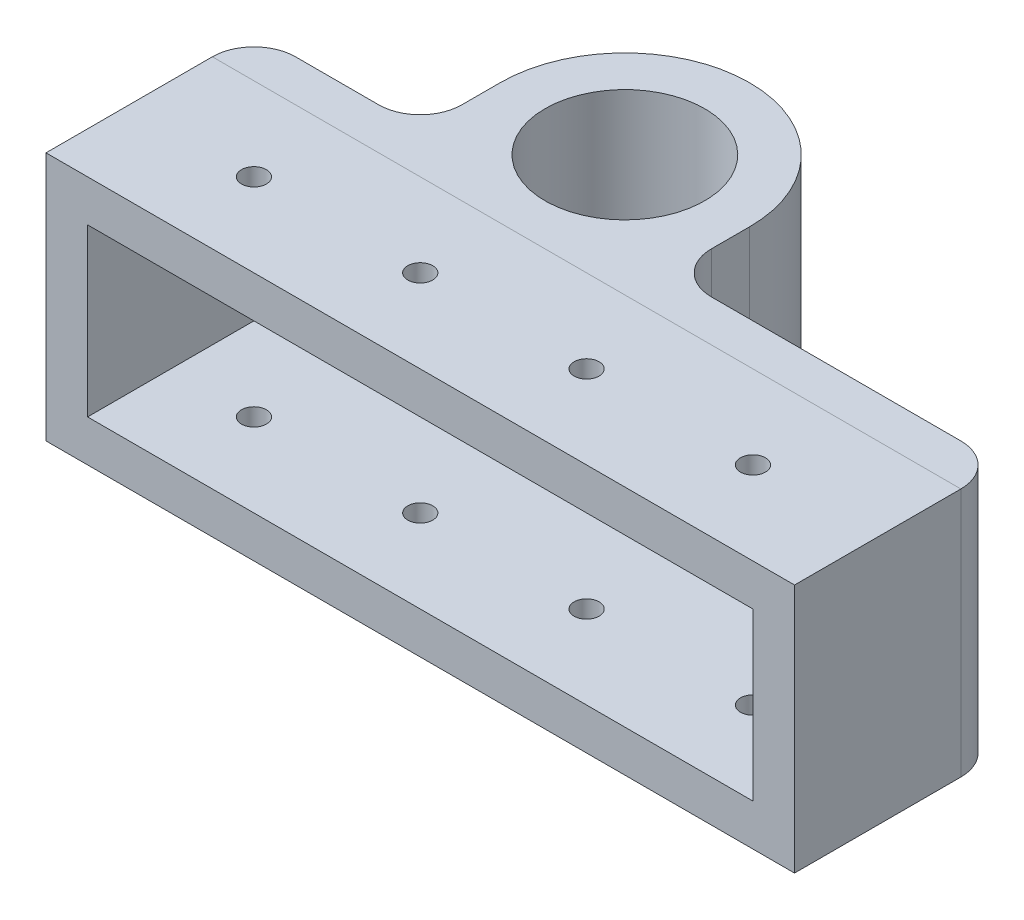
ISO-10303-21;
HEADER;
FILE_DESCRIPTION(('STEP AP214'),'2;1');
FILE_NAME('part.step','',(''),(''),'','','');
FILE_SCHEMA(('AUTOMOTIVE_DESIGN { 1 0 10303 214 1 1 1 1 }'));
ENDSEC;
DATA;
#1=APPLICATION_CONTEXT('core data for automotive mechanical design processes');
#2=APPLICATION_PROTOCOL_DEFINITION('international standard','automotive_design',2000,#1);
#3=PRODUCT_CONTEXT('',#1,'mechanical');
#4=PRODUCT('Part','Part','',(#3));
#5=PRODUCT_RELATED_PRODUCT_CATEGORY('part','',(#4));
#6=PRODUCT_DEFINITION_FORMATION('','',#4);
#7=PRODUCT_DEFINITION_CONTEXT('part definition',#1,'design');
#8=PRODUCT_DEFINITION('design','',#6,#7);
#9=PRODUCT_DEFINITION_SHAPE('','',#8);
#10=(LENGTH_UNIT() NAMED_UNIT(*) SI_UNIT(.MILLI.,.METRE.));
#11=(NAMED_UNIT(*) PLANE_ANGLE_UNIT() SI_UNIT($,.RADIAN.));
#12=(NAMED_UNIT(*) SI_UNIT($,.STERADIAN.) SOLID_ANGLE_UNIT());
#13=UNCERTAINTY_MEASURE_WITH_UNIT(LENGTH_MEASURE(1.E-05),#10,'distance_accuracy_value','');
#14=(GEOMETRIC_REPRESENTATION_CONTEXT(3) GLOBAL_UNCERTAINTY_ASSIGNED_CONTEXT((#13)) GLOBAL_UNIT_ASSIGNED_CONTEXT((#10,
#11,#12)) REPRESENTATION_CONTEXT('',''));
#15=CARTESIAN_POINT('',(0.,0.,0.));
#16=DIRECTION('',(0.,0.,1.));
#17=DIRECTION('',(1.,0.,0.));
#18=AXIS2_PLACEMENT_3D('',#15,#16,#17);
#19=CARTESIAN_POINT('',(0.,-15.,0.));
#20=DIRECTION('',(0.,0.,-1.));
#21=DIRECTION('',(-1.,0.,0.));
#22=AXIS2_PLACEMENT_3D('',#19,#20,#21);
#23=PLANE('',#22);
#24=DIRECTION('',(-1.,0.,0.));
#25=VECTOR('',#24,1.);
#26=CARTESIAN_POINT('',(0.,15.,0.));
#27=LINE('',#26,#25);
#28=CARTESIAN_POINT('',(45.,15.,0.));
#29=VERTEX_POINT('',#28);
#30=CARTESIAN_POINT('',(-45.,15.,0.));
#31=VERTEX_POINT('',#30);
#32=EDGE_CURVE('E194',#29,#31,#27,.T.);
#33=ORIENTED_EDGE('',*,*,#32,.T.);
#34=DIRECTION('',(0.,1.,0.));
#35=VECTOR('',#34,1.);
#36=CARTESIAN_POINT('',(-45.,-15.,0.));
#37=LINE('',#36,#35);
#38=CARTESIAN_POINT('',(-45.,-15.,0.));
#39=VERTEX_POINT('',#38);
#40=EDGE_CURVE('E143',#39,#31,#37,.T.);
#41=ORIENTED_EDGE('',*,*,#40,.F.);
#42=DIRECTION('',(-1.,0.,0.));
#43=VECTOR('',#42,1.);
#44=CARTESIAN_POINT('',(0.,-15.,0.));
#45=LINE('',#44,#43);
#46=CARTESIAN_POINT('',(45.,-15.,0.));
#47=VERTEX_POINT('',#46);
#48=EDGE_CURVE('E131',#47,#39,#45,.T.);
#49=ORIENTED_EDGE('',*,*,#48,.F.);
#50=DIRECTION('',(0.,1.,0.));
#51=VECTOR('',#50,1.);
#52=CARTESIAN_POINT('',(45.,-15.,0.));
#53=LINE('',#52,#51);
#54=EDGE_CURVE('E141',#47,#29,#53,.T.);
#55=ORIENTED_EDGE('',*,*,#54,.T.);
#56=EDGE_LOOP('',(#33,#41,#49,#55));
#57=FACE_BOUND('',#56,.T.);
#58=ADVANCED_FACE('F51',(#57),#23,.F.);
#59=CARTESIAN_POINT('',(0.,-15.,-5.));
#60=DIRECTION('',(0.,0.,1.));
#61=DIRECTION('',(1.,0.,0.));
#62=AXIS2_PLACEMENT_3D('',#59,#60,#61);
#63=PLANE('',#62);
#64=DIRECTION('',(1.,0.,0.));
#65=VECTOR('',#64,1.);
#66=CARTESIAN_POINT('',(0.,-15.,-5.));
#67=LINE('',#66,#65);
#68=CARTESIAN_POINT('',(-40.,-15.,-5.));
#69=VERTEX_POINT('',#68);
#70=CARTESIAN_POINT('',(-30.,-15.,-5.));
#71=VERTEX_POINT('',#70);
#72=EDGE_CURVE('E153',#69,#71,#67,.T.);
#73=ORIENTED_EDGE('',*,*,#72,.F.);
#74=DIRECTION('',(0.,1.,0.));
#75=VECTOR('',#74,1.);
#76=CARTESIAN_POINT('',(-40.,-15.,-5.));
#77=LINE('',#76,#75);
#78=CARTESIAN_POINT('',(-40.,15.,-5.));
#79=VERTEX_POINT('',#78);
#80=EDGE_CURVE('E177',#69,#79,#77,.T.);
#81=ORIENTED_EDGE('',*,*,#80,.T.);
#82=DIRECTION('',(1.,0.,0.));
#83=VECTOR('',#82,1.);
#84=CARTESIAN_POINT('',(0.,15.,-5.));
#85=LINE('',#84,#83);
#86=CARTESIAN_POINT('',(-30.,15.,-5.));
#87=VERTEX_POINT('',#86);
#88=EDGE_CURVE('E195',#79,#87,#85,.T.);
#89=ORIENTED_EDGE('',*,*,#88,.T.);
#90=DIRECTION('',(0.,1.,0.));
#91=VECTOR('',#90,1.);
#92=CARTESIAN_POINT('',(-30.,-15.,-5.));
#93=LINE('',#92,#91);
#94=EDGE_CURVE('E160',#87,#71,#93,.F.);
#95=ORIENTED_EDGE('',*,*,#94,.T.);
#96=EDGE_LOOP('',(#73,#81,#89,#95));
#97=FACE_BOUND('',#96,.T.);
#98=ADVANCED_FACE('F185',(#97),#63,.F.);
#99=CARTESIAN_POINT('',(-25.,-15.,0.));
#100=DIRECTION('',(-1.,0.,0.));
#101=DIRECTION('',(0.,-1.,0.));
#102=AXIS2_PLACEMENT_3D('',#99,#100,#101);
#103=PLANE('',#102);
#104=DIRECTION('',(0.,0.,1.));
#105=VECTOR('',#104,1.);
#106=CARTESIAN_POINT('',(-25.,-15.,0.));
#107=LINE('',#106,#105);
#108=CARTESIAN_POINT('',(-25.,-15.,-14.6));
#109=VERTEX_POINT('',#108);
#110=CARTESIAN_POINT('',(-25.,-15.,-10.));
#111=VERTEX_POINT('',#110);
#112=EDGE_CURVE('E189',#109,#111,#107,.T.);
#113=ORIENTED_EDGE('',*,*,#112,.T.);
#114=DIRECTION('',(0.,1.,0.));
#115=VECTOR('',#114,1.);
#116=CARTESIAN_POINT('',(-25.,-15.,-10.));
#117=LINE('',#116,#115);
#118=CARTESIAN_POINT('',(-25.,15.,-10.));
#119=VERTEX_POINT('',#118);
#120=EDGE_CURVE('E157',#111,#119,#117,.T.);
#121=ORIENTED_EDGE('',*,*,#120,.T.);
#122=DIRECTION('',(0.,0.,1.));
#123=VECTOR('',#122,1.);
#124=CARTESIAN_POINT('',(-25.,15.,0.));
#125=LINE('',#124,#123);
#126=CARTESIAN_POINT('',(-25.,15.,-14.6));
#127=VERTEX_POINT('',#126);
#128=EDGE_CURVE('E206',#127,#119,#125,.T.);
#129=ORIENTED_EDGE('',*,*,#128,.F.);
#130=DIRECTION('',(0.,1.,0.));
#131=VECTOR('',#130,1.);
#132=CARTESIAN_POINT('',(-25.,-15.,-14.6));
#133=LINE('',#132,#131);
#134=EDGE_CURVE('E150',#109,#127,#133,.T.);
#135=ORIENTED_EDGE('',*,*,#134,.F.);
#136=EDGE_LOOP('',(#113,#121,#129,#135));
#137=FACE_BOUND('',#136,.T.);
#138=ADVANCED_FACE('F222',(#137),#103,.T.);
#139=CARTESIAN_POINT('',(-10.,-15.,-14.6));
#140=DIRECTION('',(0.,1.,0.));
#141=DIRECTION('',(-1.,0.,0.));
#142=AXIS2_PLACEMENT_3D('',#139,#140,#141);
#143=CYLINDRICAL_SURFACE('',#142,15.);
#144=CARTESIAN_POINT('',(-10.,15.,-14.6));
#145=DIRECTION('',(0.,1.,0.));
#146=DIRECTION('',(-1.,0.,0.));
#147=AXIS2_PLACEMENT_3D('',#144,#145,#146);
#148=CIRCLE('',#147,15.);
#149=CARTESIAN_POINT('',(4.99999999999999,15.,-14.6));
#150=VERTEX_POINT('',#149);
#151=EDGE_CURVE('E203',#150,#127,#148,.T.);
#152=ORIENTED_EDGE('',*,*,#151,.F.);
#153=DIRECTION('',(0.,1.,0.));
#154=VECTOR('',#153,1.);
#155=CARTESIAN_POINT('',(4.99999999999999,-15.,-14.6));
#156=LINE('',#155,#154);
#157=CARTESIAN_POINT('',(4.99999999999999,-15.,-14.6));
#158=VERTEX_POINT('',#157);
#159=EDGE_CURVE('E147',#158,#150,#156,.T.);
#160=ORIENTED_EDGE('',*,*,#159,.F.);
#161=CARTESIAN_POINT('',(-10.,-15.,-14.6));
#162=DIRECTION('',(0.,1.,0.));
#163=DIRECTION('',(-1.,0.,0.));
#164=AXIS2_PLACEMENT_3D('',#161,#162,#163);
#165=CIRCLE('',#164,15.);
#166=EDGE_CURVE('E218',#158,#109,#165,.T.);
#167=ORIENTED_EDGE('',*,*,#166,.T.);
#168=ORIENTED_EDGE('',*,*,#134,.T.);
#169=EDGE_LOOP('',(#152,#160,#167,#168));
#170=FACE_BOUND('',#169,.T.);
#171=ADVANCED_FACE('F216',(#170),#143,.T.);
#172=CARTESIAN_POINT('',(4.99999999999999,-15.,0.));
#173=DIRECTION('',(-1.,0.,0.));
#174=DIRECTION('',(0.,0.,1.));
#175=AXIS2_PLACEMENT_3D('',#172,#173,#174);
#176=PLANE('',#175);
#177=DIRECTION('',(0.,0.,1.));
#178=VECTOR('',#177,1.);
#179=CARTESIAN_POINT('',(4.99999999999999,15.,0.));
#180=LINE('',#179,#178);
#181=CARTESIAN_POINT('',(4.99999999999999,15.,-10.));
#182=VERTEX_POINT('',#181);
#183=EDGE_CURVE('E198',#150,#182,#180,.T.);
#184=ORIENTED_EDGE('',*,*,#183,.T.);
#185=DIRECTION('',(0.,1.,0.));
#186=VECTOR('',#185,1.);
#187=CARTESIAN_POINT('',(4.99999999999999,-15.,-10.));
#188=LINE('',#187,#186);
#189=CARTESIAN_POINT('',(4.99999999999999,-15.,-10.));
#190=VERTEX_POINT('',#189);
#191=EDGE_CURVE('E166',#182,#190,#188,.F.);
#192=ORIENTED_EDGE('',*,*,#191,.T.);
#193=DIRECTION('',(0.,0.,1.));
#194=VECTOR('',#193,1.);
#195=CARTESIAN_POINT('',(4.99999999999999,-15.,0.));
#196=LINE('',#195,#194);
#197=EDGE_CURVE('E234',#158,#190,#196,.T.);
#198=ORIENTED_EDGE('',*,*,#197,.F.);
#199=ORIENTED_EDGE('',*,*,#159,.T.);
#200=EDGE_LOOP('',(#184,#192,#198,#199));
#201=FACE_BOUND('',#200,.T.);
#202=ADVANCED_FACE('F227',(#201),#176,.F.);
#203=CARTESIAN_POINT('',(0.,-15.,-5.));
#204=DIRECTION('',(0.,0.,1.));
#205=DIRECTION('',(1.,0.,0.));
#206=AXIS2_PLACEMENT_3D('',#203,#204,#205);
#207=PLANE('',#206);
#208=DIRECTION('',(1.,0.,0.));
#209=VECTOR('',#208,1.);
#210=CARTESIAN_POINT('',(0.,15.,-5.));
#211=LINE('',#210,#209);
#212=CARTESIAN_POINT('',(9.99999999999999,15.,-5.));
#213=VERTEX_POINT('',#212);
#214=CARTESIAN_POINT('',(40.,15.,-5.));
#215=VERTEX_POINT('',#214);
#216=EDGE_CURVE('E196',#213,#215,#211,.T.);
#217=ORIENTED_EDGE('',*,*,#216,.T.);
#218=DIRECTION('',(0.,1.,0.));
#219=VECTOR('',#218,1.);
#220=CARTESIAN_POINT('',(40.,-15.,-5.));
#221=LINE('',#220,#219);
#222=CARTESIAN_POINT('',(40.,-15.,-5.));
#223=VERTEX_POINT('',#222);
#224=EDGE_CURVE('E12',#215,#223,#221,.F.);
#225=ORIENTED_EDGE('',*,*,#224,.T.);
#226=DIRECTION('',(1.,0.,0.));
#227=VECTOR('',#226,1.);
#228=CARTESIAN_POINT('',(0.,-15.,-5.));
#229=LINE('',#228,#227);
#230=CARTESIAN_POINT('',(9.99999999999999,-15.,-5.));
#231=VERTEX_POINT('',#230);
#232=EDGE_CURVE('E133',#231,#223,#229,.T.);
#233=ORIENTED_EDGE('',*,*,#232,.F.);
#234=DIRECTION('',(0.,1.,0.));
#235=VECTOR('',#234,1.);
#236=CARTESIAN_POINT('',(9.99999999999999,15.,-5.));
#237=LINE('',#236,#235);
#238=EDGE_CURVE('E163',#231,#213,#237,.T.);
#239=ORIENTED_EDGE('',*,*,#238,.T.);
#240=EDGE_LOOP('',(#217,#225,#233,#239));
#241=FACE_BOUND('',#240,.T.);
#242=ADVANCED_FACE('F235',(#241),#207,.F.);
#243=CARTESIAN_POINT('',(-10.,-15.,-14.6));
#244=DIRECTION('',(0.,1.,0.));
#245=DIRECTION('',(-1.,0.,0.));
#246=AXIS2_PLACEMENT_3D('',#243,#244,#245);
#247=CYLINDRICAL_SURFACE('',#246,9.6);
#248=CARTESIAN_POINT('',(-10.,-15.,-14.6));
#249=DIRECTION('',(0.,1.,0.));
#250=DIRECTION('',(-1.,0.,0.));
#251=AXIS2_PLACEMENT_3D('',#248,#249,#250);
#252=CIRCLE('',#251,9.6);
#253=CARTESIAN_POINT('',(-19.6,-15.,-14.6));
#254=VERTEX_POINT('',#253);
#255=EDGE_CURVE('E148',#254,#254,#252,.T.);
#256=ORIENTED_EDGE('',*,*,#255,.F.);
#257=EDGE_LOOP('',(#256));
#258=FACE_BOUND('',#257,.T.);
#259=CARTESIAN_POINT('',(-10.,15.,-14.6));
#260=DIRECTION('',(0.,1.,0.));
#261=DIRECTION('',(-1.,0.,0.));
#262=AXIS2_PLACEMENT_3D('',#259,#260,#261);
#263=CIRCLE('',#262,9.6);
#264=CARTESIAN_POINT('',(-19.6,15.,-14.6));
#265=VERTEX_POINT('',#264);
#266=EDGE_CURVE('E145',#265,#265,#263,.T.);
#267=ORIENTED_EDGE('',*,*,#266,.T.);
#268=EDGE_LOOP('',(#267));
#269=FACE_BOUND('',#268,.T.);
#270=ADVANCED_FACE('F260',(#258,#269),#247,.F.);
#271=CARTESIAN_POINT('',(0.,-15.,0.));
#272=DIRECTION('',(0.,1.,0.));
#273=DIRECTION('',(-1.,0.,0.));
#274=AXIS2_PLACEMENT_3D('',#271,#272,#273);
#275=PLANE('',#274);
#276=ORIENTED_EDGE('',*,*,#48,.T.);
#277=CARTESIAN_POINT('',(-40.,-15.,0.));
#278=DIRECTION('',(0.,1.,0.));
#279=DIRECTION('',(-1.,0.,0.));
#280=AXIS2_PLACEMENT_3D('',#277,#278,#279);
#281=CIRCLE('',#280,5.);
#282=EDGE_CURVE('E59',#39,#69,#281,.F.);
#283=ORIENTED_EDGE('',*,*,#282,.T.);
#284=ORIENTED_EDGE('',*,*,#72,.T.);
#285=CARTESIAN_POINT('',(-30.,-15.,-10.));
#286=DIRECTION('',(0.,1.,0.));
#287=DIRECTION('',(-1.,0.,0.));
#288=AXIS2_PLACEMENT_3D('',#285,#286,#287);
#289=CIRCLE('',#288,5.);
#290=EDGE_CURVE('E171',#71,#111,#289,.T.);
#291=ORIENTED_EDGE('',*,*,#290,.T.);
#292=ORIENTED_EDGE('',*,*,#112,.F.);
#293=ORIENTED_EDGE('',*,*,#166,.F.);
#294=ORIENTED_EDGE('',*,*,#197,.T.);
#295=CARTESIAN_POINT('',(9.99999999999999,-15.,-10.));
#296=DIRECTION('',(0.,1.,0.));
#297=DIRECTION('',(-1.,0.,0.));
#298=AXIS2_PLACEMENT_3D('',#295,#296,#297);
#299=CIRCLE('',#298,5.);
#300=EDGE_CURVE('E175',#190,#231,#299,.T.);
#301=ORIENTED_EDGE('',*,*,#300,.T.);
#302=ORIENTED_EDGE('',*,*,#232,.T.);
#303=CARTESIAN_POINT('',(40.,-15.,0.));
#304=DIRECTION('',(0.,1.,0.));
#305=DIRECTION('',(-1.,0.,0.));
#306=AXIS2_PLACEMENT_3D('',#303,#304,#305);
#307=CIRCLE('',#306,5.);
#308=EDGE_CURVE('E127',#223,#47,#307,.F.);
#309=ORIENTED_EDGE('',*,*,#308,.T.);
#310=EDGE_LOOP('',(#276,#283,#284,#291,#292,#293,#294,#301,#302,#309));
#311=FACE_BOUND('',#310,.T.);
#312=ORIENTED_EDGE('',*,*,#255,.T.);
#313=EDGE_LOOP('',(#312));
#314=FACE_BOUND('',#313,.T.);
#315=ADVANCED_FACE('F129',(#311,#314),#275,.F.);
#316=CARTESIAN_POINT('',(0.,15.,0.));
#317=DIRECTION('',(0.,1.,0.));
#318=DIRECTION('',(-1.,0.,0.));
#319=AXIS2_PLACEMENT_3D('',#316,#317,#318);
#320=PLANE('',#319);
#321=ORIENTED_EDGE('',*,*,#88,.F.);
#322=CARTESIAN_POINT('',(-40.,15.,0.));
#323=DIRECTION('',(0.,1.,0.));
#324=DIRECTION('',(-1.,0.,0.));
#325=AXIS2_PLACEMENT_3D('',#322,#323,#324);
#326=CIRCLE('',#325,5.);
#327=EDGE_CURVE('E136',#79,#31,#326,.T.);
#328=ORIENTED_EDGE('',*,*,#327,.T.);
#329=ORIENTED_EDGE('',*,*,#32,.F.);
#330=CARTESIAN_POINT('',(40.,15.,0.));
#331=DIRECTION('',(0.,1.,0.));
#332=DIRECTION('',(-1.,0.,0.));
#333=AXIS2_PLACEMENT_3D('',#330,#331,#332);
#334=CIRCLE('',#333,5.);
#335=EDGE_CURVE('E72',#29,#215,#334,.T.);
#336=ORIENTED_EDGE('',*,*,#335,.T.);
#337=ORIENTED_EDGE('',*,*,#216,.F.);
#338=CARTESIAN_POINT('',(9.99999999999999,15.,-10.));
#339=DIRECTION('',(0.,1.,0.));
#340=DIRECTION('',(-1.,0.,0.));
#341=AXIS2_PLACEMENT_3D('',#338,#339,#340);
#342=CIRCLE('',#341,5.);
#343=EDGE_CURVE('E173',#213,#182,#342,.F.);
#344=ORIENTED_EDGE('',*,*,#343,.T.);
#345=ORIENTED_EDGE('',*,*,#183,.F.);
#346=ORIENTED_EDGE('',*,*,#151,.T.);
#347=ORIENTED_EDGE('',*,*,#128,.T.);
#348=CARTESIAN_POINT('',(-30.,15.,-10.));
#349=DIRECTION('',(0.,1.,0.));
#350=DIRECTION('',(-1.,0.,0.));
#351=AXIS2_PLACEMENT_3D('',#348,#349,#350);
#352=CIRCLE('',#351,5.);
#353=EDGE_CURVE('E168',#119,#87,#352,.F.);
#354=ORIENTED_EDGE('',*,*,#353,.T.);
#355=EDGE_LOOP('',(#321,#328,#329,#336,#337,#344,#345,#346,#347,#354));
#356=FACE_BOUND('',#355,.T.);
#357=ORIENTED_EDGE('',*,*,#266,.F.);
#358=EDGE_LOOP('',(#357));
#359=FACE_BOUND('',#358,.T.);
#360=ADVANCED_FACE('F192',(#356,#359),#320,.T.);
#361=CARTESIAN_POINT('',(-30.,-15.,-10.));
#362=DIRECTION('',(0.,1.,0.));
#363=DIRECTION('',(-1.,0.,0.));
#364=AXIS2_PLACEMENT_3D('',#361,#362,#363);
#365=CYLINDRICAL_SURFACE('',#364,5.);
#366=ORIENTED_EDGE('',*,*,#290,.F.);
#367=ORIENTED_EDGE('',*,*,#94,.F.);
#368=ORIENTED_EDGE('',*,*,#353,.F.);
#369=ORIENTED_EDGE('',*,*,#120,.F.);
#370=EDGE_LOOP('',(#366,#367,#368,#369));
#371=FACE_BOUND('',#370,.T.);
#372=ADVANCED_FACE('F241',(#371),#365,.F.);
#373=CARTESIAN_POINT('',(9.99999999999999,-15.,-10.));
#374=DIRECTION('',(0.,-1.,0.));
#375=DIRECTION('',(1.,0.,0.));
#376=AXIS2_PLACEMENT_3D('',#373,#374,#375);
#377=CYLINDRICAL_SURFACE('',#376,5.);
#378=ORIENTED_EDGE('',*,*,#300,.F.);
#379=ORIENTED_EDGE('',*,*,#191,.F.);
#380=ORIENTED_EDGE('',*,*,#343,.F.);
#381=ORIENTED_EDGE('',*,*,#238,.F.);
#382=EDGE_LOOP('',(#378,#379,#380,#381));
#383=FACE_BOUND('',#382,.T.);
#384=ADVANCED_FACE('F232',(#383),#377,.F.);
#385=CARTESIAN_POINT('',(-40.,-15.,0.));
#386=DIRECTION('',(0.,1.,0.));
#387=DIRECTION('',(-1.,0.,0.));
#388=AXIS2_PLACEMENT_3D('',#385,#386,#387);
#389=CYLINDRICAL_SURFACE('',#388,5.);
#390=ORIENTED_EDGE('',*,*,#282,.F.);
#391=ORIENTED_EDGE('',*,*,#40,.T.);
#392=ORIENTED_EDGE('',*,*,#327,.F.);
#393=ORIENTED_EDGE('',*,*,#80,.F.);
#394=EDGE_LOOP('',(#390,#391,#392,#393));
#395=FACE_BOUND('',#394,.T.);
#396=ADVANCED_FACE('F191',(#395),#389,.T.);
#397=CARTESIAN_POINT('',(40.,-15.,0.));
#398=DIRECTION('',(0.,-1.,0.));
#399=DIRECTION('',(1.,0.,0.));
#400=AXIS2_PLACEMENT_3D('',#397,#398,#399);
#401=CYLINDRICAL_SURFACE('',#400,5.);
#402=ORIENTED_EDGE('',*,*,#308,.F.);
#403=ORIENTED_EDGE('',*,*,#224,.F.);
#404=ORIENTED_EDGE('',*,*,#335,.F.);
#405=ORIENTED_EDGE('',*,*,#54,.F.);
#406=EDGE_LOOP('',(#402,#403,#404,#405));
#407=FACE_BOUND('',#406,.T.);
#408=ADVANCED_FACE('F53',(#407),#401,.T.);
#409=CLOSED_SHELL('',(#58,#98,#138,#171,#202,#242,#270,#315,#360,#372,#384,#396,#408));
#410=MANIFOLD_SOLID_BREP('B2',#409);
#411=CARTESIAN_POINT('',(0.,0.,20.));
#412=DIRECTION('',(0.,0.,1.));
#413=DIRECTION('',(1.,0.,0.));
#414=AXIS2_PLACEMENT_3D('',#411,#412,#413);
#415=PLANE('',#414);
#416=DIRECTION('',(0.,-1.,0.));
#417=VECTOR('',#416,1.);
#418=CARTESIAN_POINT('',(-45.,-15.,20.));
#419=LINE('',#418,#417);
#420=CARTESIAN_POINT('',(-45.,15.,20.));
#421=VERTEX_POINT('',#420);
#422=CARTESIAN_POINT('',(-45.,-15.,20.));
#423=VERTEX_POINT('',#422);
#424=EDGE_CURVE('E482',#421,#423,#419,.T.);
#425=ORIENTED_EDGE('',*,*,#424,.T.);
#426=DIRECTION('',(1.,0.,0.));
#427=VECTOR('',#426,1.);
#428=CARTESIAN_POINT('',(45.,-15.,20.));
#429=LINE('',#428,#427);
#430=CARTESIAN_POINT('',(45.,-15.,20.));
#431=VERTEX_POINT('',#430);
#432=EDGE_CURVE('E485',#423,#431,#429,.T.);
#433=ORIENTED_EDGE('',*,*,#432,.T.);
#434=DIRECTION('',(0.,1.,0.));
#435=VECTOR('',#434,1.);
#436=CARTESIAN_POINT('',(45.,-15.,20.));
#437=LINE('',#436,#435);
#438=CARTESIAN_POINT('',(45.,15.,20.));
#439=VERTEX_POINT('',#438);
#440=EDGE_CURVE('E488',#431,#439,#437,.T.);
#441=ORIENTED_EDGE('',*,*,#440,.T.);
#442=DIRECTION('',(-1.,0.,0.));
#443=VECTOR('',#442,1.);
#444=CARTESIAN_POINT('',(45.,15.,20.));
#445=LINE('',#444,#443);
#446=EDGE_CURVE('E490',#439,#421,#445,.T.);
#447=ORIENTED_EDGE('',*,*,#446,.T.);
#448=EDGE_LOOP('',(#425,#433,#441,#447));
#449=FACE_BOUND('',#448,.T.);
#450=DIRECTION('',(-1.,0.,0.));
#451=VECTOR('',#450,1.);
#452=CARTESIAN_POINT('',(-40.,10.,20.));
#453=LINE('',#452,#451);
#454=CARTESIAN_POINT('',(40.,10.,20.));
#455=VERTEX_POINT('',#454);
#456=CARTESIAN_POINT('',(-40.,10.,20.));
#457=VERTEX_POINT('',#456);
#458=EDGE_CURVE('E452',#455,#457,#453,.T.);
#459=ORIENTED_EDGE('',*,*,#458,.F.);
#460=DIRECTION('',(0.,1.,0.));
#461=VECTOR('',#460,1.);
#462=CARTESIAN_POINT('',(40.,-10.,20.));
#463=LINE('',#462,#461);
#464=CARTESIAN_POINT('',(40.,-10.,20.));
#465=VERTEX_POINT('',#464);
#466=EDGE_CURVE('E444',#465,#455,#463,.T.);
#467=ORIENTED_EDGE('',*,*,#466,.F.);
#468=DIRECTION('',(1.,0.,0.));
#469=VECTOR('',#468,1.);
#470=CARTESIAN_POINT('',(-40.,-10.,20.));
#471=LINE('',#470,#469);
#472=CARTESIAN_POINT('',(-40.,-10.,20.));
#473=VERTEX_POINT('',#472);
#474=EDGE_CURVE('E466',#473,#465,#471,.T.);
#475=ORIENTED_EDGE('',*,*,#474,.F.);
#476=DIRECTION('',(0.,-1.,0.));
#477=VECTOR('',#476,1.);
#478=CARTESIAN_POINT('',(-40.,-10.,20.));
#479=LINE('',#478,#477);
#480=EDGE_CURVE('E464',#457,#473,#479,.T.);
#481=ORIENTED_EDGE('',*,*,#480,.F.);
#482=EDGE_LOOP('',(#459,#467,#475,#481));
#483=FACE_BOUND('',#482,.T.);
#484=ADVANCED_FACE('F377',(#449,#483),#415,.T.);
#485=CARTESIAN_POINT('',(0.,0.,0.));
#486=DIRECTION('',(0.,0.,1.));
#487=DIRECTION('',(1.,0.,0.));
#488=AXIS2_PLACEMENT_3D('',#485,#486,#487);
#489=PLANE('',#488);
#490=DIRECTION('',(0.,-1.,0.));
#491=VECTOR('',#490,1.);
#492=CARTESIAN_POINT('',(-45.,-15.,0.));
#493=LINE('',#492,#491);
#494=CARTESIAN_POINT('',(-45.,15.,0.));
#495=VERTEX_POINT('',#494);
#496=CARTESIAN_POINT('',(-45.,-15.,0.));
#497=VERTEX_POINT('',#496);
#498=EDGE_CURVE('E460',#495,#497,#493,.T.);
#499=ORIENTED_EDGE('',*,*,#498,.F.);
#500=DIRECTION('',(-1.,0.,0.));
#501=VECTOR('',#500,1.);
#502=CARTESIAN_POINT('',(45.,15.,0.));
#503=LINE('',#502,#501);
#504=CARTESIAN_POINT('',(45.,15.,0.));
#505=VERTEX_POINT('',#504);
#506=EDGE_CURVE('E486',#505,#495,#503,.T.);
#507=ORIENTED_EDGE('',*,*,#506,.F.);
#508=DIRECTION('',(0.,1.,0.));
#509=VECTOR('',#508,1.);
#510=CARTESIAN_POINT('',(45.,-15.,0.));
#511=LINE('',#510,#509);
#512=CARTESIAN_POINT('',(45.,-15.,0.));
#513=VERTEX_POINT('',#512);
#514=EDGE_CURVE('E497',#513,#505,#511,.T.);
#515=ORIENTED_EDGE('',*,*,#514,.F.);
#516=DIRECTION('',(1.,0.,0.));
#517=VECTOR('',#516,1.);
#518=CARTESIAN_POINT('',(45.,-15.,0.));
#519=LINE('',#518,#517);
#520=EDGE_CURVE('E495',#497,#513,#519,.T.);
#521=ORIENTED_EDGE('',*,*,#520,.F.);
#522=EDGE_LOOP('',(#499,#507,#515,#521));
#523=FACE_BOUND('',#522,.T.);
#524=DIRECTION('',(0.,1.,0.));
#525=VECTOR('',#524,1.);
#526=CARTESIAN_POINT('',(40.,-10.,0.));
#527=LINE('',#526,#525);
#528=CARTESIAN_POINT('',(40.,-10.,0.));
#529=VERTEX_POINT('',#528);
#530=CARTESIAN_POINT('',(40.,10.,0.));
#531=VERTEX_POINT('',#530);
#532=EDGE_CURVE('E402',#529,#531,#527,.T.);
#533=ORIENTED_EDGE('',*,*,#532,.T.);
#534=DIRECTION('',(-1.,0.,0.));
#535=VECTOR('',#534,1.);
#536=CARTESIAN_POINT('',(-40.,10.,0.));
#537=LINE('',#536,#535);
#538=CARTESIAN_POINT('',(-40.,10.,0.));
#539=VERTEX_POINT('',#538);
#540=EDGE_CURVE('E459',#531,#539,#537,.T.);
#541=ORIENTED_EDGE('',*,*,#540,.T.);
#542=DIRECTION('',(0.,-1.,0.));
#543=VECTOR('',#542,1.);
#544=CARTESIAN_POINT('',(-40.,-10.,0.));
#545=LINE('',#544,#543);
#546=CARTESIAN_POINT('',(-40.,-10.,0.));
#547=VERTEX_POINT('',#546);
#548=EDGE_CURVE('E474',#539,#547,#545,.T.);
#549=ORIENTED_EDGE('',*,*,#548,.T.);
#550=DIRECTION('',(1.,0.,0.));
#551=VECTOR('',#550,1.);
#552=CARTESIAN_POINT('',(-40.,-10.,0.));
#553=LINE('',#552,#551);
#554=EDGE_CURVE('E453',#547,#529,#553,.T.);
#555=ORIENTED_EDGE('',*,*,#554,.T.);
#556=EDGE_LOOP('',(#533,#541,#549,#555));
#557=FACE_BOUND('',#556,.T.);
#558=ADVANCED_FACE('F549',(#523,#557),#489,.F.);
#559=CARTESIAN_POINT('',(-45.,-15.,20.));
#560=DIRECTION('',(1.,0.,0.));
#561=DIRECTION('',(0.,0.,-1.));
#562=AXIS2_PLACEMENT_3D('',#559,#560,#561);
#563=PLANE('',#562);
#564=ORIENTED_EDGE('',*,*,#498,.T.);
#565=DIRECTION('',(0.,0.,-1.));
#566=VECTOR('',#565,1.);
#567=CARTESIAN_POINT('',(-45.,-15.,20.));
#568=LINE('',#567,#566);
#569=EDGE_CURVE('E49',#423,#497,#568,.T.);
#570=ORIENTED_EDGE('',*,*,#569,.F.);
#571=ORIENTED_EDGE('',*,*,#424,.F.);
#572=DIRECTION('',(0.,0.,-1.));
#573=VECTOR('',#572,1.);
#574=CARTESIAN_POINT('',(-45.,15.,20.));
#575=LINE('',#574,#573);
#576=EDGE_CURVE('E492',#421,#495,#575,.T.);
#577=ORIENTED_EDGE('',*,*,#576,.T.);
#578=EDGE_LOOP('',(#564,#570,#571,#577));
#579=FACE_BOUND('',#578,.T.);
#580=ADVANCED_FACE('F379',(#579),#563,.F.);
#581=CARTESIAN_POINT('',(45.,-15.,20.));
#582=DIRECTION('',(0.,1.,0.));
#583=DIRECTION('',(-1.,0.,0.));
#584=AXIS2_PLACEMENT_3D('',#581,#582,#583);
#585=PLANE('',#584);
#586=CARTESIAN_POINT('',(30.,-15.,10.));
#587=DIRECTION('',(0.,-1.,0.));
#588=DIRECTION('',(1.,0.,0.));
#589=AXIS2_PLACEMENT_3D('',#586,#587,#588);
#590=CIRCLE('',#589,1.5);
#591=CARTESIAN_POINT('',(31.5,-15.,10.));
#592=VERTEX_POINT('',#591);
#593=EDGE_CURVE('E586',#592,#592,#590,.T.);
#594=ORIENTED_EDGE('',*,*,#593,.F.);
#595=EDGE_LOOP('',(#594));
#596=FACE_BOUND('',#595,.T.);
#597=CARTESIAN_POINT('',(9.99999999999999,-15.,10.));
#598=DIRECTION('',(0.,-1.,0.));
#599=DIRECTION('',(1.,0.,0.));
#600=AXIS2_PLACEMENT_3D('',#597,#598,#599);
#601=CIRCLE('',#600,1.5);
#602=CARTESIAN_POINT('',(11.5,-15.,10.));
#603=VERTEX_POINT('',#602);
#604=EDGE_CURVE('E590',#603,#603,#601,.T.);
#605=ORIENTED_EDGE('',*,*,#604,.F.);
#606=EDGE_LOOP('',(#605));
#607=FACE_BOUND('',#606,.T.);
#608=CARTESIAN_POINT('',(-10.,-15.,10.));
#609=DIRECTION('',(0.,-1.,0.));
#610=DIRECTION('',(1.,0.,0.));
#611=AXIS2_PLACEMENT_3D('',#608,#609,#610);
#612=CIRCLE('',#611,1.5);
#613=CARTESIAN_POINT('',(-8.5,-15.,10.));
#614=VERTEX_POINT('',#613);
#615=EDGE_CURVE('E594',#614,#614,#612,.T.);
#616=ORIENTED_EDGE('',*,*,#615,.F.);
#617=EDGE_LOOP('',(#616));
#618=FACE_BOUND('',#617,.T.);
#619=CARTESIAN_POINT('',(-30.,-15.,10.));
#620=DIRECTION('',(0.,-1.,0.));
#621=DIRECTION('',(1.,0.,0.));
#622=AXIS2_PLACEMENT_3D('',#619,#620,#621);
#623=CIRCLE('',#622,1.5);
#624=CARTESIAN_POINT('',(-28.5,-15.,10.));
#625=VERTEX_POINT('',#624);
#626=EDGE_CURVE('E598',#625,#625,#623,.T.);
#627=ORIENTED_EDGE('',*,*,#626,.F.);
#628=EDGE_LOOP('',(#627));
#629=FACE_BOUND('',#628,.T.);
#630=ORIENTED_EDGE('',*,*,#520,.T.);
#631=DIRECTION('',(0.,0.,-1.));
#632=VECTOR('',#631,1.);
#633=CARTESIAN_POINT('',(45.,-15.,20.));
#634=LINE('',#633,#632);
#635=EDGE_CURVE('E386',#431,#513,#634,.T.);
#636=ORIENTED_EDGE('',*,*,#635,.F.);
#637=ORIENTED_EDGE('',*,*,#432,.F.);
#638=ORIENTED_EDGE('',*,*,#569,.T.);
#639=EDGE_LOOP('',(#630,#636,#637,#638));
#640=FACE_BOUND('',#639,.T.);
#641=ADVANCED_FACE('F576',(#596,#607,#618,#629,#640),#585,.F.);
#642=CARTESIAN_POINT('',(45.,-15.,20.));
#643=DIRECTION('',(-1.,0.,0.));
#644=DIRECTION('',(0.,0.,1.));
#645=AXIS2_PLACEMENT_3D('',#642,#643,#644);
#646=PLANE('',#645);
#647=ORIENTED_EDGE('',*,*,#514,.T.);
#648=DIRECTION('',(0.,0.,-1.));
#649=VECTOR('',#648,1.);
#650=CARTESIAN_POINT('',(45.,15.,20.));
#651=LINE('',#650,#649);
#652=EDGE_CURVE('E502',#439,#505,#651,.T.);
#653=ORIENTED_EDGE('',*,*,#652,.F.);
#654=ORIENTED_EDGE('',*,*,#440,.F.);
#655=ORIENTED_EDGE('',*,*,#635,.T.);
#656=EDGE_LOOP('',(#647,#653,#654,#655));
#657=FACE_BOUND('',#656,.T.);
#658=ADVANCED_FACE('F573',(#657),#646,.F.);
#659=CARTESIAN_POINT('',(45.,15.,20.));
#660=DIRECTION('',(0.,-1.,0.));
#661=DIRECTION('',(1.,0.,0.));
#662=AXIS2_PLACEMENT_3D('',#659,#660,#661);
#663=PLANE('',#662);
#664=CARTESIAN_POINT('',(30.,15.,10.));
#665=DIRECTION('',(0.,-1.,0.));
#666=DIRECTION('',(1.,0.,0.));
#667=AXIS2_PLACEMENT_3D('',#664,#665,#666);
#668=CIRCLE('',#667,1.5);
#669=CARTESIAN_POINT('',(31.5,15.,10.));
#670=VERTEX_POINT('',#669);
#671=EDGE_CURVE('E511',#670,#670,#668,.T.);
#672=ORIENTED_EDGE('',*,*,#671,.T.);
#673=EDGE_LOOP('',(#672));
#674=FACE_BOUND('',#673,.T.);
#675=CARTESIAN_POINT('',(9.99999999999999,15.,10.));
#676=DIRECTION('',(0.,-1.,0.));
#677=DIRECTION('',(1.,0.,0.));
#678=AXIS2_PLACEMENT_3D('',#675,#676,#677);
#679=CIRCLE('',#678,1.5);
#680=CARTESIAN_POINT('',(11.5,15.,10.));
#681=VERTEX_POINT('',#680);
#682=EDGE_CURVE('E620',#681,#681,#679,.T.);
#683=ORIENTED_EDGE('',*,*,#682,.T.);
#684=EDGE_LOOP('',(#683));
#685=FACE_BOUND('',#684,.T.);
#686=CARTESIAN_POINT('',(-10.,15.,10.));
#687=DIRECTION('',(0.,-1.,0.));
#688=DIRECTION('',(1.,0.,0.));
#689=AXIS2_PLACEMENT_3D('',#686,#687,#688);
#690=CIRCLE('',#689,1.5);
#691=CARTESIAN_POINT('',(-8.50000000000001,15.,10.));
#692=VERTEX_POINT('',#691);
#693=EDGE_CURVE('E616',#692,#692,#690,.T.);
#694=ORIENTED_EDGE('',*,*,#693,.T.);
#695=EDGE_LOOP('',(#694));
#696=FACE_BOUND('',#695,.T.);
#697=CARTESIAN_POINT('',(-30.,15.,10.));
#698=DIRECTION('',(0.,-1.,0.));
#699=DIRECTION('',(1.,0.,0.));
#700=AXIS2_PLACEMENT_3D('',#697,#698,#699);
#701=CIRCLE('',#700,1.5);
#702=CARTESIAN_POINT('',(-28.5,15.,10.));
#703=VERTEX_POINT('',#702);
#704=EDGE_CURVE('E611',#703,#703,#701,.T.);
#705=ORIENTED_EDGE('',*,*,#704,.T.);
#706=EDGE_LOOP('',(#705));
#707=FACE_BOUND('',#706,.T.);
#708=ORIENTED_EDGE('',*,*,#506,.T.);
#709=ORIENTED_EDGE('',*,*,#576,.F.);
#710=ORIENTED_EDGE('',*,*,#446,.F.);
#711=ORIENTED_EDGE('',*,*,#652,.T.);
#712=EDGE_LOOP('',(#708,#709,#710,#711));
#713=FACE_BOUND('',#712,.T.);
#714=ADVANCED_FACE('F570',(#674,#685,#696,#707,#713),#663,.F.);
#715=CARTESIAN_POINT('',(40.,-10.,20.));
#716=DIRECTION('',(-1.,0.,0.));
#717=DIRECTION('',(0.,0.,1.));
#718=AXIS2_PLACEMENT_3D('',#715,#716,#717);
#719=PLANE('',#718);
#720=ORIENTED_EDGE('',*,*,#532,.F.);
#721=DIRECTION('',(0.,0.,-1.));
#722=VECTOR('',#721,1.);
#723=CARTESIAN_POINT('',(40.,-10.,20.));
#724=LINE('',#723,#722);
#725=EDGE_CURVE('E448',#465,#529,#724,.T.);
#726=ORIENTED_EDGE('',*,*,#725,.F.);
#727=ORIENTED_EDGE('',*,*,#466,.T.);
#728=DIRECTION('',(0.,0.,-1.));
#729=VECTOR('',#728,1.);
#730=CARTESIAN_POINT('',(40.,10.,20.));
#731=LINE('',#730,#729);
#732=EDGE_CURVE('E447',#455,#531,#731,.T.);
#733=ORIENTED_EDGE('',*,*,#732,.T.);
#734=EDGE_LOOP('',(#720,#726,#727,#733));
#735=FACE_BOUND('',#734,.T.);
#736=ADVANCED_FACE('F446',(#735),#719,.T.);
#737=CARTESIAN_POINT('',(-40.,10.,20.));
#738=DIRECTION('',(0.,-1.,0.));
#739=DIRECTION('',(0.,0.,-1.));
#740=AXIS2_PLACEMENT_3D('',#737,#738,#739);
#741=PLANE('',#740);
#742=CARTESIAN_POINT('',(30.,10.,10.));
#743=DIRECTION('',(0.,-1.,0.));
#744=DIRECTION('',(0.,0.,-1.));
#745=AXIS2_PLACEMENT_3D('',#742,#743,#744);
#746=CIRCLE('',#745,1.5);
#747=CARTESIAN_POINT('',(30.,10.,8.49999999999999));
#748=VERTEX_POINT('',#747);
#749=EDGE_CURVE('E472',#748,#748,#746,.T.);
#750=ORIENTED_EDGE('',*,*,#749,.F.);
#751=EDGE_LOOP('',(#750));
#752=FACE_BOUND('',#751,.T.);
#753=CARTESIAN_POINT('',(9.99999999999999,10.,10.));
#754=DIRECTION('',(0.,-1.,0.));
#755=DIRECTION('',(0.,0.,-1.));
#756=AXIS2_PLACEMENT_3D('',#753,#754,#755);
#757=CIRCLE('',#756,1.5);
#758=CARTESIAN_POINT('',(9.99999999999999,10.,8.5));
#759=VERTEX_POINT('',#758);
#760=EDGE_CURVE('E517',#759,#759,#757,.T.);
#761=ORIENTED_EDGE('',*,*,#760,.F.);
#762=EDGE_LOOP('',(#761));
#763=FACE_BOUND('',#762,.T.);
#764=CARTESIAN_POINT('',(-10.,10.,10.));
#765=DIRECTION('',(0.,-1.,0.));
#766=DIRECTION('',(0.,0.,-1.));
#767=AXIS2_PLACEMENT_3D('',#764,#765,#766);
#768=CIRCLE('',#767,1.5);
#769=CARTESIAN_POINT('',(-10.,10.,8.5));
#770=VERTEX_POINT('',#769);
#771=EDGE_CURVE('E514',#770,#770,#768,.T.);
#772=ORIENTED_EDGE('',*,*,#771,.F.);
#773=EDGE_LOOP('',(#772));
#774=FACE_BOUND('',#773,.T.);
#775=CARTESIAN_POINT('',(-30.,10.,10.));
#776=DIRECTION('',(0.,-1.,0.));
#777=DIRECTION('',(0.,0.,-1.));
#778=AXIS2_PLACEMENT_3D('',#775,#776,#777);
#779=CIRCLE('',#778,1.5);
#780=CARTESIAN_POINT('',(-30.,10.,8.5));
#781=VERTEX_POINT('',#780);
#782=EDGE_CURVE('E510',#781,#781,#779,.T.);
#783=ORIENTED_EDGE('',*,*,#782,.F.);
#784=EDGE_LOOP('',(#783));
#785=FACE_BOUND('',#784,.T.);
#786=ORIENTED_EDGE('',*,*,#540,.F.);
#787=ORIENTED_EDGE('',*,*,#732,.F.);
#788=ORIENTED_EDGE('',*,*,#458,.T.);
#789=DIRECTION('',(0.,0.,-1.));
#790=VECTOR('',#789,1.);
#791=CARTESIAN_POINT('',(-40.,10.,20.));
#792=LINE('',#791,#790);
#793=EDGE_CURVE('E461',#457,#539,#792,.T.);
#794=ORIENTED_EDGE('',*,*,#793,.T.);
#795=EDGE_LOOP('',(#786,#787,#788,#794));
#796=FACE_BOUND('',#795,.T.);
#797=ADVANCED_FACE('F456',(#752,#763,#774,#785,#796),#741,.T.);
#798=CARTESIAN_POINT('',(-40.,-10.,20.));
#799=DIRECTION('',(1.,0.,0.));
#800=DIRECTION('',(0.,0.,-1.));
#801=AXIS2_PLACEMENT_3D('',#798,#799,#800);
#802=PLANE('',#801);
#803=ORIENTED_EDGE('',*,*,#548,.F.);
#804=ORIENTED_EDGE('',*,*,#793,.F.);
#805=ORIENTED_EDGE('',*,*,#480,.T.);
#806=DIRECTION('',(0.,0.,-1.));
#807=VECTOR('',#806,1.);
#808=CARTESIAN_POINT('',(-40.,-10.,20.));
#809=LINE('',#808,#807);
#810=EDGE_CURVE('E394',#473,#547,#809,.T.);
#811=ORIENTED_EDGE('',*,*,#810,.T.);
#812=EDGE_LOOP('',(#803,#804,#805,#811));
#813=FACE_BOUND('',#812,.T.);
#814=ADVANCED_FACE('F541',(#813),#802,.T.);
#815=CARTESIAN_POINT('',(-40.,-10.,20.));
#816=DIRECTION('',(0.,1.,0.));
#817=DIRECTION('',(0.,0.,1.));
#818=AXIS2_PLACEMENT_3D('',#815,#816,#817);
#819=PLANE('',#818);
#820=CARTESIAN_POINT('',(30.,-10.,10.));
#821=DIRECTION('',(0.,1.,0.));
#822=DIRECTION('',(0.,0.,1.));
#823=AXIS2_PLACEMENT_3D('',#820,#821,#822);
#824=CIRCLE('',#823,1.5);
#825=CARTESIAN_POINT('',(30.,-10.,11.5));
#826=VERTEX_POINT('',#825);
#827=EDGE_CURVE('E381',#826,#826,#824,.T.);
#828=ORIENTED_EDGE('',*,*,#827,.F.);
#829=EDGE_LOOP('',(#828));
#830=FACE_BOUND('',#829,.T.);
#831=CARTESIAN_POINT('',(9.99999999999999,-10.,10.));
#832=DIRECTION('',(0.,1.,0.));
#833=DIRECTION('',(0.,0.,1.));
#834=AXIS2_PLACEMENT_3D('',#831,#832,#833);
#835=CIRCLE('',#834,1.5);
#836=CARTESIAN_POINT('',(9.99999999999999,-10.,11.5));
#837=VERTEX_POINT('',#836);
#838=EDGE_CURVE('E515',#837,#837,#835,.T.);
#839=ORIENTED_EDGE('',*,*,#838,.F.);
#840=EDGE_LOOP('',(#839));
#841=FACE_BOUND('',#840,.T.);
#842=CARTESIAN_POINT('',(-10.,-10.,10.));
#843=DIRECTION('',(0.,1.,0.));
#844=DIRECTION('',(0.,0.,1.));
#845=AXIS2_PLACEMENT_3D('',#842,#843,#844);
#846=CIRCLE('',#845,1.5);
#847=CARTESIAN_POINT('',(-10.,-10.,11.5));
#848=VERTEX_POINT('',#847);
#849=EDGE_CURVE('E512',#848,#848,#846,.T.);
#850=ORIENTED_EDGE('',*,*,#849,.F.);
#851=EDGE_LOOP('',(#850));
#852=FACE_BOUND('',#851,.T.);
#853=CARTESIAN_POINT('',(-30.,-10.,10.));
#854=DIRECTION('',(0.,1.,0.));
#855=DIRECTION('',(0.,0.,1.));
#856=AXIS2_PLACEMENT_3D('',#853,#854,#855);
#857=CIRCLE('',#856,1.5);
#858=CARTESIAN_POINT('',(-30.,-10.,11.5));
#859=VERTEX_POINT('',#858);
#860=EDGE_CURVE('E507',#859,#859,#857,.T.);
#861=ORIENTED_EDGE('',*,*,#860,.F.);
#862=EDGE_LOOP('',(#861));
#863=FACE_BOUND('',#862,.T.);
#864=ORIENTED_EDGE('',*,*,#554,.F.);
#865=ORIENTED_EDGE('',*,*,#810,.F.);
#866=ORIENTED_EDGE('',*,*,#474,.T.);
#867=ORIENTED_EDGE('',*,*,#725,.T.);
#868=EDGE_LOOP('',(#864,#865,#866,#867));
#869=FACE_BOUND('',#868,.T.);
#870=ADVANCED_FACE('F537',(#830,#841,#852,#863,#869),#819,.T.);
#871=CARTESIAN_POINT('',(-30.,15.,10.));
#872=DIRECTION('',(0.,-1.,0.));
#873=DIRECTION('',(1.,0.,0.));
#874=AXIS2_PLACEMENT_3D('',#871,#872,#873);
#875=CYLINDRICAL_SURFACE('',#874,1.5);
#876=ORIENTED_EDGE('',*,*,#860,.T.);
#877=EDGE_LOOP('',(#876));
#878=FACE_BOUND('',#877,.T.);
#879=ORIENTED_EDGE('',*,*,#626,.T.);
#880=EDGE_LOOP('',(#879));
#881=FACE_BOUND('',#880,.T.);
#882=ADVANCED_FACE('F540',(#878,#881),#875,.F.);
#883=CARTESIAN_POINT('',(-10.,15.,10.));
#884=DIRECTION('',(0.,-1.,0.));
#885=DIRECTION('',(1.,0.,0.));
#886=AXIS2_PLACEMENT_3D('',#883,#884,#885);
#887=CYLINDRICAL_SURFACE('',#886,1.5);
#888=ORIENTED_EDGE('',*,*,#849,.T.);
#889=EDGE_LOOP('',(#888));
#890=FACE_BOUND('',#889,.T.);
#891=ORIENTED_EDGE('',*,*,#615,.T.);
#892=EDGE_LOOP('',(#891));
#893=FACE_BOUND('',#892,.T.);
#894=ADVANCED_FACE('F647',(#890,#893),#887,.F.);
#895=CARTESIAN_POINT('',(9.99999999999999,15.,10.));
#896=DIRECTION('',(0.,-1.,0.));
#897=DIRECTION('',(1.,0.,0.));
#898=AXIS2_PLACEMENT_3D('',#895,#896,#897);
#899=CYLINDRICAL_SURFACE('',#898,1.5);
#900=ORIENTED_EDGE('',*,*,#838,.T.);
#901=EDGE_LOOP('',(#900));
#902=FACE_BOUND('',#901,.T.);
#903=ORIENTED_EDGE('',*,*,#604,.T.);
#904=EDGE_LOOP('',(#903));
#905=FACE_BOUND('',#904,.T.);
#906=ADVANCED_FACE('F638',(#902,#905),#899,.F.);
#907=CARTESIAN_POINT('',(30.,15.,10.));
#908=DIRECTION('',(0.,-1.,0.));
#909=DIRECTION('',(1.,0.,0.));
#910=AXIS2_PLACEMENT_3D('',#907,#908,#909);
#911=CYLINDRICAL_SURFACE('',#910,1.5);
#912=ORIENTED_EDGE('',*,*,#827,.T.);
#913=EDGE_LOOP('',(#912));
#914=FACE_BOUND('',#913,.T.);
#915=ORIENTED_EDGE('',*,*,#593,.T.);
#916=EDGE_LOOP('',(#915));
#917=FACE_BOUND('',#916,.T.);
#918=ADVANCED_FACE('F534',(#914,#917),#911,.F.);
#919=ORIENTED_EDGE('',*,*,#782,.T.);
#920=EDGE_LOOP('',(#919));
#921=FACE_BOUND('',#920,.T.);
#922=ORIENTED_EDGE('',*,*,#704,.F.);
#923=EDGE_LOOP('',(#922));
#924=FACE_BOUND('',#923,.T.);
#925=ADVANCED_FACE('F640',(#921,#924),#875,.F.);
#926=ORIENTED_EDGE('',*,*,#771,.T.);
#927=EDGE_LOOP('',(#926));
#928=FACE_BOUND('',#927,.T.);
#929=ORIENTED_EDGE('',*,*,#693,.F.);
#930=EDGE_LOOP('',(#929));
#931=FACE_BOUND('',#930,.T.);
#932=ADVANCED_FACE('F635',(#928,#931),#887,.F.);
#933=ORIENTED_EDGE('',*,*,#760,.T.);
#934=EDGE_LOOP('',(#933));
#935=FACE_BOUND('',#934,.T.);
#936=ORIENTED_EDGE('',*,*,#682,.F.);
#937=EDGE_LOOP('',(#936));
#938=FACE_BOUND('',#937,.T.);
#939=ADVANCED_FACE('F630',(#935,#938),#899,.F.);
#940=ORIENTED_EDGE('',*,*,#749,.T.);
#941=EDGE_LOOP('',(#940));
#942=FACE_BOUND('',#941,.T.);
#943=ORIENTED_EDGE('',*,*,#671,.F.);
#944=EDGE_LOOP('',(#943));
#945=FACE_BOUND('',#944,.T.);
#946=ADVANCED_FACE('F628',(#942,#945),#911,.F.);
#947=CLOSED_SHELL('',(#484,#558,#580,#641,#658,#714,#736,#797,#814,#870,#882,#894,#906,#918,
#925,#932,#939,#946));
#948=MANIFOLD_SOLID_BREP('B6',#947);
#949=ADVANCED_BREP_SHAPE_REPRESENTATION('',(#18,#410,#948),#14);
#950=SHAPE_DEFINITION_REPRESENTATION(#9,#949);
ENDSEC;
END-ISO-10303-21;
